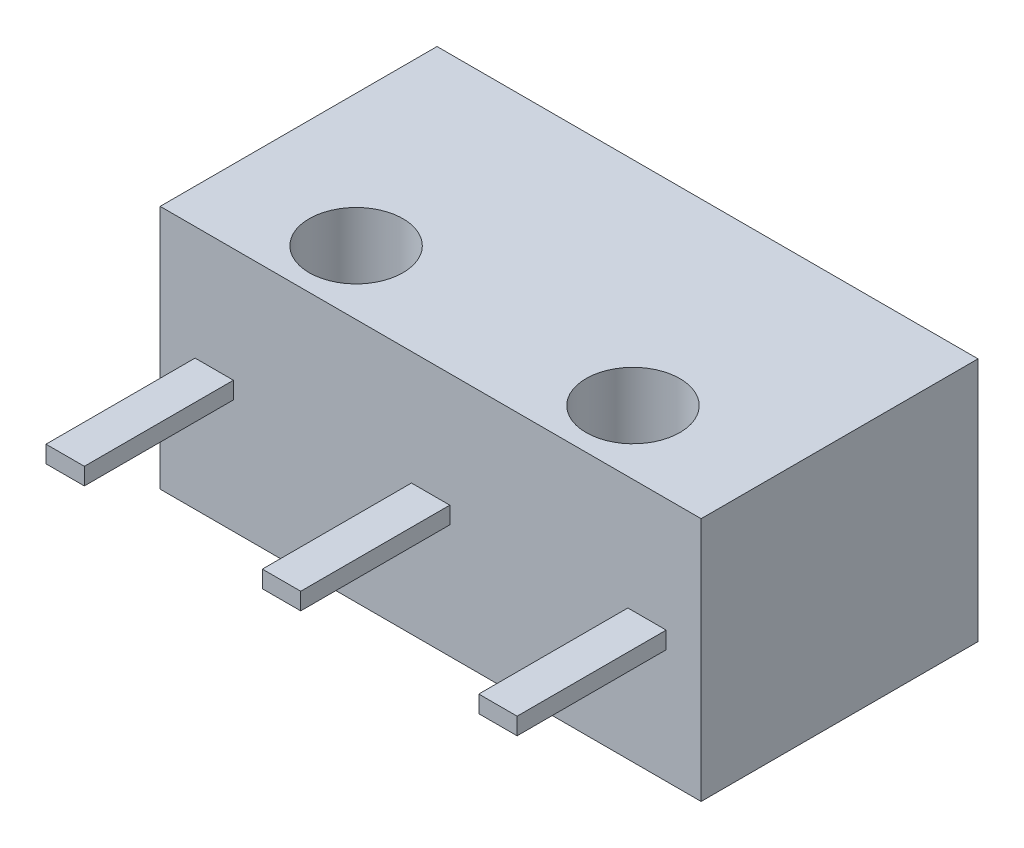
ISO-10303-21;
HEADER;
FILE_DESCRIPTION(('STEP AP214'),'2;1');
FILE_NAME('part.step','',(''),(''),'','','');
FILE_SCHEMA(('AUTOMOTIVE_DESIGN { 1 0 10303 214 1 1 1 1 }'));
ENDSEC;
DATA;
#1=APPLICATION_CONTEXT('core data for automotive mechanical design processes');
#2=APPLICATION_PROTOCOL_DEFINITION('international standard','automotive_design',2000,#1);
#3=PRODUCT_CONTEXT('',#1,'mechanical');
#4=PRODUCT('Part','Part','',(#3));
#5=PRODUCT_RELATED_PRODUCT_CATEGORY('part','',(#4));
#6=PRODUCT_DEFINITION_FORMATION('','',#4);
#7=PRODUCT_DEFINITION_CONTEXT('part definition',#1,'design');
#8=PRODUCT_DEFINITION('design','',#6,#7);
#9=PRODUCT_DEFINITION_SHAPE('','',#8);
#10=(LENGTH_UNIT() NAMED_UNIT(*) SI_UNIT(.MILLI.,.METRE.));
#11=(NAMED_UNIT(*) PLANE_ANGLE_UNIT() SI_UNIT($,.RADIAN.));
#12=(NAMED_UNIT(*) SI_UNIT($,.STERADIAN.) SOLID_ANGLE_UNIT());
#13=UNCERTAINTY_MEASURE_WITH_UNIT(LENGTH_MEASURE(1.E-05),#10,'distance_accuracy_value','');
#14=(GEOMETRIC_REPRESENTATION_CONTEXT(3) GLOBAL_UNCERTAINTY_ASSIGNED_CONTEXT((#13)) GLOBAL_UNIT_ASSIGNED_CONTEXT((#10,
#11,#12)) REPRESENTATION_CONTEXT('',''));
#15=CARTESIAN_POINT('',(0.,0.,0.));
#16=DIRECTION('',(0.,0.,1.));
#17=DIRECTION('',(1.,0.,0.));
#18=AXIS2_PLACEMENT_3D('',#15,#16,#17);
#19=CARTESIAN_POINT('',(0.,5.74999999999998,0.));
#20=DIRECTION('',(0.,0.,-1.));
#21=DIRECTION('',(-1.,0.,0.));
#22=AXIS2_PLACEMENT_3D('',#19,#20,#21);
#23=PLANE('',#22);
#24=DIRECTION('',(1.,0.,0.));
#25=VECTOR('',#24,1.);
#26=CARTESIAN_POINT('',(0.,0.,0.));
#27=LINE('',#26,#25);
#28=CARTESIAN_POINT('',(0.,0.,0.));
#29=VERTEX_POINT('',#28);
#30=CARTESIAN_POINT('',(12.7,0.,0.));
#31=VERTEX_POINT('',#30);
#32=EDGE_CURVE('E295',#29,#31,#27,.T.);
#33=ORIENTED_EDGE('',*,*,#32,.T.);
#34=DIRECTION('',(0.,-1.,0.));
#35=VECTOR('',#34,1.);
#36=CARTESIAN_POINT('',(12.6999999999999,5.75000000000001,0.));
#37=LINE('',#36,#35);
#38=CARTESIAN_POINT('',(12.6999999999999,5.75000000000001,0.));
#39=VERTEX_POINT('',#38);
#40=EDGE_CURVE('E42',#39,#31,#37,.T.);
#41=ORIENTED_EDGE('',*,*,#40,.F.);
#42=DIRECTION('',(1.,0.,0.));
#43=VECTOR('',#42,1.);
#44=CARTESIAN_POINT('',(0.,5.74999999999998,0.));
#45=LINE('',#44,#43);
#46=CARTESIAN_POINT('',(0.,5.74999999999998,0.));
#47=VERTEX_POINT('',#46);
#48=EDGE_CURVE('E285',#47,#39,#45,.T.);
#49=ORIENTED_EDGE('',*,*,#48,.F.);
#50=DIRECTION('',(0.,-1.,0.));
#51=VECTOR('',#50,1.);
#52=CARTESIAN_POINT('',(0.,5.74999999999998,0.));
#53=LINE('',#52,#51);
#54=EDGE_CURVE('E11',#47,#29,#53,.T.);
#55=ORIENTED_EDGE('',*,*,#54,.T.);
#56=EDGE_LOOP('',(#33,#41,#49,#55));
#57=FACE_BOUND('',#56,.T.);
#58=DIRECTION('',(0.,1.,0.));
#59=VECTOR('',#58,1.);
#60=CARTESIAN_POINT('',(6.79999999999992,2.67499999999998,0.));
#61=LINE('',#60,#59);
#62=CARTESIAN_POINT('',(6.79999999999992,2.67499999999998,0.));
#63=VERTEX_POINT('',#62);
#64=CARTESIAN_POINT('',(6.8,3.07500000000002,0.));
#65=VERTEX_POINT('',#64);
#66=EDGE_CURVE('E264',#63,#65,#61,.T.);
#67=ORIENTED_EDGE('',*,*,#66,.F.);
#68=DIRECTION('',(-0.999999999999999,0.,0.));
#69=VECTOR('',#68,1.);
#70=CARTESIAN_POINT('',(5.90000000000002,2.67500000000001,0.));
#71=LINE('',#70,#69);
#72=CARTESIAN_POINT('',(5.90000000000002,2.67500000000001,0.));
#73=VERTEX_POINT('',#72);
#74=EDGE_CURVE('E258',#63,#73,#71,.T.);
#75=ORIENTED_EDGE('',*,*,#74,.T.);
#76=DIRECTION('',(0.,1.,0.));
#77=VECTOR('',#76,1.);
#78=CARTESIAN_POINT('',(5.90000000000002,2.67500000000001,0.));
#79=LINE('',#78,#77);
#80=CARTESIAN_POINT('',(5.90000000000002,3.07499999999997,0.));
#81=VERTEX_POINT('',#80);
#82=EDGE_CURVE('E261',#73,#81,#79,.T.);
#83=ORIENTED_EDGE('',*,*,#82,.T.);
#84=DIRECTION('',(-0.999999999999999,0.,0.));
#85=VECTOR('',#84,1.);
#86=CARTESIAN_POINT('',(5.90000000000002,3.07499999999997,0.));
#87=LINE('',#86,#85);
#88=EDGE_CURVE('E246',#65,#81,#87,.T.);
#89=ORIENTED_EDGE('',*,*,#88,.F.);
#90=EDGE_LOOP('',(#67,#75,#83,#89));
#91=FACE_BOUND('',#90,.T.);
#92=DIRECTION('',(0.,1.,0.));
#93=VECTOR('',#92,1.);
#94=CARTESIAN_POINT('',(11.88,2.67499999999998,0.));
#95=LINE('',#94,#93);
#96=CARTESIAN_POINT('',(11.88,2.67499999999998,0.));
#97=VERTEX_POINT('',#96);
#98=CARTESIAN_POINT('',(11.8799999999999,3.07499999999999,0.));
#99=VERTEX_POINT('',#98);
#100=EDGE_CURVE('E234',#97,#99,#95,.T.);
#101=ORIENTED_EDGE('',*,*,#100,.F.);
#102=DIRECTION('',(-0.999999999999999,0.,0.));
#103=VECTOR('',#102,1.);
#104=CARTESIAN_POINT('',(11.88,2.67499999999998,0.));
#105=LINE('',#104,#103);
#106=CARTESIAN_POINT('',(10.9799999999999,2.67499999999996,0.));
#107=VERTEX_POINT('',#106);
#108=EDGE_CURVE('E223',#97,#107,#105,.T.);
#109=ORIENTED_EDGE('',*,*,#108,.T.);
#110=DIRECTION('',(0.,1.,0.));
#111=VECTOR('',#110,1.);
#112=CARTESIAN_POINT('',(10.9799999999999,2.67499999999996,0.));
#113=LINE('',#112,#111);
#114=CARTESIAN_POINT('',(10.98,3.07499999999999,0.));
#115=VERTEX_POINT('',#114);
#116=EDGE_CURVE('E232',#107,#115,#113,.T.);
#117=ORIENTED_EDGE('',*,*,#116,.T.);
#118=DIRECTION('',(-0.999999999999999,0.,0.));
#119=VECTOR('',#118,1.);
#120=CARTESIAN_POINT('',(11.8799999999999,3.07499999999999,0.));
#121=LINE('',#120,#119);
#122=EDGE_CURVE('E212',#99,#115,#121,.T.);
#123=ORIENTED_EDGE('',*,*,#122,.F.);
#124=EDGE_LOOP('',(#101,#109,#117,#123));
#125=FACE_BOUND('',#124,.T.);
#126=DIRECTION('',(-0.999999999999999,0.,0.));
#127=VECTOR('',#126,1.);
#128=CARTESIAN_POINT('',(0.819999999999932,2.67499999999996,0.));
#129=LINE('',#128,#127);
#130=CARTESIAN_POINT('',(1.72,2.67499999999998,0.));
#131=VERTEX_POINT('',#130);
#132=CARTESIAN_POINT('',(0.819999999999932,2.67499999999996,0.));
#133=VERTEX_POINT('',#132);
#134=EDGE_CURVE('E193',#131,#133,#129,.T.);
#135=ORIENTED_EDGE('',*,*,#134,.T.);
#136=DIRECTION('',(0.,1.,0.));
#137=VECTOR('',#136,1.);
#138=CARTESIAN_POINT('',(0.819999999999932,2.67499999999996,0.));
#139=LINE('',#138,#137);
#140=CARTESIAN_POINT('',(0.819999999999932,3.07499999999994,0.));
#141=VERTEX_POINT('',#140);
#142=EDGE_CURVE('E197',#133,#141,#139,.T.);
#143=ORIENTED_EDGE('',*,*,#142,.T.);
#144=DIRECTION('',(-0.999999999999999,0.,0.));
#145=VECTOR('',#144,1.);
#146=CARTESIAN_POINT('',(0.819999999999932,3.07499999999994,0.));
#147=LINE('',#146,#145);
#148=CARTESIAN_POINT('',(1.72000000000005,3.07500000000002,0.));
#149=VERTEX_POINT('',#148);
#150=EDGE_CURVE('E184',#149,#141,#147,.T.);
#151=ORIENTED_EDGE('',*,*,#150,.F.);
#152=DIRECTION('',(0.,1.,0.));
#153=VECTOR('',#152,1.);
#154=CARTESIAN_POINT('',(1.72,2.67499999999998,0.));
#155=LINE('',#154,#153);
#156=EDGE_CURVE('E201',#131,#149,#155,.T.);
#157=ORIENTED_EDGE('',*,*,#156,.F.);
#158=EDGE_LOOP('',(#135,#143,#151,#157));
#159=FACE_BOUND('',#158,.T.);
#160=ADVANCED_FACE('F34',(#57,#91,#125,#159),#23,.F.);
#161=CARTESIAN_POINT('',(0.,5.74999999999998,0.));
#162=DIRECTION('',(1.,0.,0.));
#163=DIRECTION('',(0.,0.,-1.));
#164=AXIS2_PLACEMENT_3D('',#161,#162,#163);
#165=PLANE('',#164);
#166=DIRECTION('',(0.,0.,1.));
#167=VECTOR('',#166,1.);
#168=CARTESIAN_POINT('',(0.,0.,0.));
#169=LINE('',#168,#167);
#170=CARTESIAN_POINT('',(0.,0.,-6.50000000000001));
#171=VERTEX_POINT('',#170);
#172=EDGE_CURVE('E273',#171,#29,#169,.T.);
#173=ORIENTED_EDGE('',*,*,#172,.T.);
#174=ORIENTED_EDGE('',*,*,#54,.F.);
#175=DIRECTION('',(0.,0.,1.));
#176=VECTOR('',#175,1.);
#177=CARTESIAN_POINT('',(0.,5.74999999999998,0.));
#178=LINE('',#177,#176);
#179=CARTESIAN_POINT('',(0.,5.75000000000003,-6.50000000000001));
#180=VERTEX_POINT('',#179);
#181=EDGE_CURVE('E282',#180,#47,#178,.T.);
#182=ORIENTED_EDGE('',*,*,#181,.F.);
#183=DIRECTION('',(0.,-1.,0.));
#184=VECTOR('',#183,1.);
#185=CARTESIAN_POINT('',(0.,5.75000000000003,-6.50000000000001));
#186=LINE('',#185,#184);
#187=EDGE_CURVE('E292',#180,#171,#186,.T.);
#188=ORIENTED_EDGE('',*,*,#187,.T.);
#189=EDGE_LOOP('',(#173,#174,#182,#188));
#190=FACE_BOUND('',#189,.T.);
#191=ADVANCED_FACE('F36',(#190),#165,.F.);
#192=CARTESIAN_POINT('',(12.6999999999999,5.75000000000001,0.));
#193=DIRECTION('',(-1.,0.,0.));
#194=DIRECTION('',(0.,0.,1.));
#195=AXIS2_PLACEMENT_3D('',#192,#193,#194);
#196=PLANE('',#195);
#197=DIRECTION('',(0.,0.,-1.));
#198=VECTOR('',#197,1.);
#199=CARTESIAN_POINT('',(12.7,0.,0.));
#200=LINE('',#199,#198);
#201=CARTESIAN_POINT('',(12.7,0.,-6.50000000000006));
#202=VERTEX_POINT('',#201);
#203=EDGE_CURVE('E297',#31,#202,#200,.T.);
#204=ORIENTED_EDGE('',*,*,#203,.T.);
#205=DIRECTION('',(0.,-1.,0.));
#206=VECTOR('',#205,1.);
#207=CARTESIAN_POINT('',(12.6999999999999,5.74999999999998,-6.50000000000001));
#208=LINE('',#207,#206);
#209=CARTESIAN_POINT('',(12.6999999999999,5.74999999999998,-6.50000000000001));
#210=VERTEX_POINT('',#209);
#211=EDGE_CURVE('E302',#210,#202,#208,.T.);
#212=ORIENTED_EDGE('',*,*,#211,.F.);
#213=DIRECTION('',(0.,0.,-1.));
#214=VECTOR('',#213,1.);
#215=CARTESIAN_POINT('',(12.6999999999999,5.75000000000001,0.));
#216=LINE('',#215,#214);
#217=EDGE_CURVE('E288',#39,#210,#216,.T.);
#218=ORIENTED_EDGE('',*,*,#217,.F.);
#219=ORIENTED_EDGE('',*,*,#40,.T.);
#220=EDGE_LOOP('',(#204,#212,#218,#219));
#221=FACE_BOUND('',#220,.T.);
#222=ADVANCED_FACE('F309',(#221),#196,.F.);
#223=CARTESIAN_POINT('',(0.,5.75000000000003,-6.50000000000001));
#224=DIRECTION('',(0.,0.,1.));
#225=DIRECTION('',(1.,0.,0.));
#226=AXIS2_PLACEMENT_3D('',#223,#224,#225);
#227=PLANE('',#226);
#228=DIRECTION('',(0.,1.,0.));
#229=VECTOR('',#228,1.);
#230=CARTESIAN_POINT('',(3.80000000000003,1.42500000000001,-6.49999999999995));
#231=LINE('',#230,#229);
#232=CARTESIAN_POINT('',(3.80000000000003,1.42500000000001,-6.49999999999995));
#233=VERTEX_POINT('',#232);
#234=CARTESIAN_POINT('',(3.79999999999997,4.325,-6.50000000000001));
#235=VERTEX_POINT('',#234);
#236=EDGE_CURVE('E54',#233,#235,#231,.T.);
#237=ORIENTED_EDGE('',*,*,#236,.F.);
#238=DIRECTION('',(0.999999999999999,0.,0.));
#239=VECTOR('',#238,1.);
#240=CARTESIAN_POINT('',(3.80000000000003,1.42500000000001,-6.49999999999995));
#241=LINE('',#240,#239);
#242=CARTESIAN_POINT('',(4.99999999999989,1.42500000000001,-6.50000000000001));
#243=VERTEX_POINT('',#242);
#244=EDGE_CURVE('E49',#233,#243,#241,.T.);
#245=ORIENTED_EDGE('',*,*,#244,.T.);
#246=DIRECTION('',(0.,1.,0.));
#247=VECTOR('',#246,1.);
#248=CARTESIAN_POINT('',(4.99999999999989,1.42500000000001,-6.50000000000001));
#249=LINE('',#248,#247);
#250=CARTESIAN_POINT('',(5.,4.325,-6.50000000000001));
#251=VERTEX_POINT('',#250);
#252=EDGE_CURVE('E155',#243,#251,#249,.T.);
#253=ORIENTED_EDGE('',*,*,#252,.T.);
#254=DIRECTION('',(0.999999999999999,0.,0.));
#255=VECTOR('',#254,1.);
#256=CARTESIAN_POINT('',(3.79999999999997,4.325,-6.50000000000001));
#257=LINE('',#256,#255);
#258=EDGE_CURVE('E159',#235,#251,#257,.T.);
#259=ORIENTED_EDGE('',*,*,#258,.F.);
#260=EDGE_LOOP('',(#237,#245,#253,#259));
#261=FACE_BOUND('',#260,.T.);
#262=DIRECTION('',(-1.,0.,0.));
#263=VECTOR('',#262,1.);
#264=CARTESIAN_POINT('',(0.,0.,-6.50000000000001));
#265=LINE('',#264,#263);
#266=EDGE_CURVE('E286',#202,#171,#265,.T.);
#267=ORIENTED_EDGE('',*,*,#266,.T.);
#268=ORIENTED_EDGE('',*,*,#187,.F.);
#269=DIRECTION('',(-1.,0.,0.));
#270=VECTOR('',#269,1.);
#271=CARTESIAN_POINT('',(0.,5.75000000000003,-6.50000000000001));
#272=LINE('',#271,#270);
#273=EDGE_CURVE('E290',#210,#180,#272,.T.);
#274=ORIENTED_EDGE('',*,*,#273,.F.);
#275=ORIENTED_EDGE('',*,*,#211,.T.);
#276=EDGE_LOOP('',(#267,#268,#274,#275));
#277=FACE_BOUND('',#276,.T.);
#278=ADVANCED_FACE('F157',(#261,#277),#227,.F.);
#279=CARTESIAN_POINT('',(0.,5.74999999999998,0.));
#280=DIRECTION('',(0.,-1.,0.));
#281=DIRECTION('',(0.,0.,-1.));
#282=AXIS2_PLACEMENT_3D('',#279,#280,#281);
#283=PLANE('',#282);
#284=CARTESIAN_POINT('',(3.09999999999999,5.74999999999998,-1.5));
#285=DIRECTION('',(0.,1.,0.));
#286=DIRECTION('',(0.,0.,1.));
#287=AXIS2_PLACEMENT_3D('',#284,#285,#286);
#288=CIRCLE('',#287,1.1);
#289=CARTESIAN_POINT('',(3.09999999999999,5.74999999999998,-0.400000000000001));
#290=VERTEX_POINT('',#289);
#291=EDGE_CURVE('E274',#290,#290,#288,.T.);
#292=ORIENTED_EDGE('',*,*,#291,.F.);
#293=EDGE_LOOP('',(#292));
#294=FACE_BOUND('',#293,.T.);
#295=CARTESIAN_POINT('',(9.60000000000002,5.75000000000001,-1.5));
#296=DIRECTION('',(0.,1.,0.));
#297=DIRECTION('',(0.,0.,1.));
#298=AXIS2_PLACEMENT_3D('',#295,#296,#297);
#299=CIRCLE('',#298,1.1);
#300=CARTESIAN_POINT('',(9.60000000000002,5.75000000000001,-0.4));
#301=VERTEX_POINT('',#300);
#302=EDGE_CURVE('E263',#301,#301,#299,.T.);
#303=ORIENTED_EDGE('',*,*,#302,.F.);
#304=EDGE_LOOP('',(#303));
#305=FACE_BOUND('',#304,.T.);
#306=ORIENTED_EDGE('',*,*,#181,.T.);
#307=ORIENTED_EDGE('',*,*,#48,.T.);
#308=ORIENTED_EDGE('',*,*,#217,.T.);
#309=ORIENTED_EDGE('',*,*,#273,.T.);
#310=EDGE_LOOP('',(#306,#307,#308,#309));
#311=FACE_BOUND('',#310,.T.);
#312=ADVANCED_FACE('F322',(#294,#305,#311),#283,.F.);
#313=CARTESIAN_POINT('',(0.,0.,0.));
#314=DIRECTION('',(0.,-1.,0.));
#315=DIRECTION('',(0.,0.,-1.));
#316=AXIS2_PLACEMENT_3D('',#313,#314,#315);
#317=PLANE('',#316);
#318=CARTESIAN_POINT('',(3.09999999999999,0.,-1.5));
#319=DIRECTION('',(0.,1.,0.));
#320=DIRECTION('',(0.,0.,1.));
#321=AXIS2_PLACEMENT_3D('',#318,#319,#320);
#322=CIRCLE('',#321,1.1);
#323=CARTESIAN_POINT('',(3.09999999999999,0.,-0.400000000000001));
#324=VERTEX_POINT('',#323);
#325=EDGE_CURVE('E270',#324,#324,#322,.T.);
#326=ORIENTED_EDGE('',*,*,#325,.T.);
#327=EDGE_LOOP('',(#326));
#328=FACE_BOUND('',#327,.T.);
#329=CARTESIAN_POINT('',(9.59999999999991,0.,-1.5));
#330=DIRECTION('',(0.,1.,0.));
#331=DIRECTION('',(0.,0.,1.));
#332=AXIS2_PLACEMENT_3D('',#329,#330,#331);
#333=CIRCLE('',#332,1.1);
#334=CARTESIAN_POINT('',(9.59999999999991,0.,-0.4));
#335=VERTEX_POINT('',#334);
#336=EDGE_CURVE('E277',#335,#335,#333,.T.);
#337=ORIENTED_EDGE('',*,*,#336,.T.);
#338=EDGE_LOOP('',(#337));
#339=FACE_BOUND('',#338,.T.);
#340=ORIENTED_EDGE('',*,*,#172,.F.);
#341=ORIENTED_EDGE('',*,*,#266,.F.);
#342=ORIENTED_EDGE('',*,*,#203,.F.);
#343=ORIENTED_EDGE('',*,*,#32,.F.);
#344=EDGE_LOOP('',(#340,#341,#342,#343));
#345=FACE_BOUND('',#344,.T.);
#346=ADVANCED_FACE('F315',(#328,#339,#345),#317,.T.);
#347=CARTESIAN_POINT('',(9.59999999999991,0.,-1.5));
#348=DIRECTION('',(0.,1.,0.));
#349=DIRECTION('',(0.,0.,1.));
#350=AXIS2_PLACEMENT_3D('',#347,#348,#349);
#351=CYLINDRICAL_SURFACE('',#350,1.1);
#352=ORIENTED_EDGE('',*,*,#336,.F.);
#353=EDGE_LOOP('',(#352));
#354=FACE_BOUND('',#353,.T.);
#355=ORIENTED_EDGE('',*,*,#302,.T.);
#356=EDGE_LOOP('',(#355));
#357=FACE_BOUND('',#356,.T.);
#358=ADVANCED_FACE('F402',(#354,#357),#351,.F.);
#359=CARTESIAN_POINT('',(3.09999999999999,0.,-1.5));
#360=DIRECTION('',(0.,1.,0.));
#361=DIRECTION('',(0.,0.,1.));
#362=AXIS2_PLACEMENT_3D('',#359,#360,#361);
#363=CYLINDRICAL_SURFACE('',#362,1.1);
#364=ORIENTED_EDGE('',*,*,#325,.F.);
#365=EDGE_LOOP('',(#364));
#366=FACE_BOUND('',#365,.T.);
#367=ORIENTED_EDGE('',*,*,#291,.T.);
#368=EDGE_LOOP('',(#367));
#369=FACE_BOUND('',#368,.T.);
#370=ADVANCED_FACE('F398',(#366,#369),#363,.F.);
#371=CARTESIAN_POINT('',(5.90000000000002,2.67500000000001,3.5));
#372=DIRECTION('',(-1.,0.,0.));
#373=DIRECTION('',(0.,0.,1.));
#374=AXIS2_PLACEMENT_3D('',#371,#372,#373);
#375=PLANE('',#374);
#376=DIRECTION('',(0.,1.,0.));
#377=VECTOR('',#376,1.);
#378=CARTESIAN_POINT('',(5.90000000000002,2.67500000000001,3.5));
#379=LINE('',#378,#377);
#380=CARTESIAN_POINT('',(5.90000000000002,2.67500000000001,3.5));
#381=VERTEX_POINT('',#380);
#382=CARTESIAN_POINT('',(5.89999999999993,3.07499999999999,3.49999999999995));
#383=VERTEX_POINT('',#382);
#384=EDGE_CURVE('E260',#381,#383,#379,.T.);
#385=ORIENTED_EDGE('',*,*,#384,.T.);
#386=DIRECTION('',(0.,0.,1.));
#387=VECTOR('',#386,1.);
#388=CARTESIAN_POINT('',(5.89999999999993,3.07499999999999,3.49999999999995));
#389=LINE('',#388,#387);
#390=EDGE_CURVE('E231',#81,#383,#389,.T.);
#391=ORIENTED_EDGE('',*,*,#390,.F.);
#392=ORIENTED_EDGE('',*,*,#82,.F.);
#393=DIRECTION('',(0.,0.,1.));
#394=VECTOR('',#393,1.);
#395=CARTESIAN_POINT('',(5.90000000000002,2.67500000000001,3.5));
#396=LINE('',#395,#394);
#397=EDGE_CURVE('E249',#73,#381,#396,.T.);
#398=ORIENTED_EDGE('',*,*,#397,.T.);
#399=EDGE_LOOP('',(#385,#391,#392,#398));
#400=FACE_BOUND('',#399,.T.);
#401=ADVANCED_FACE('F391',(#400),#375,.T.);
#402=CARTESIAN_POINT('',(6.79999999999997,2.67500000000001,3.5));
#403=DIRECTION('',(1.,0.,0.));
#404=DIRECTION('',(0.,0.,-1.));
#405=AXIS2_PLACEMENT_3D('',#402,#403,#404);
#406=PLANE('',#405);
#407=ORIENTED_EDGE('',*,*,#66,.T.);
#408=DIRECTION('',(0.,0.,-1.));
#409=VECTOR('',#408,1.);
#410=CARTESIAN_POINT('',(6.80000000000003,3.07499999999999,3.49999999999995));
#411=LINE('',#410,#409);
#412=CARTESIAN_POINT('',(6.80000000000003,3.07499999999999,3.49999999999995));
#413=VERTEX_POINT('',#412);
#414=EDGE_CURVE('E243',#413,#65,#411,.T.);
#415=ORIENTED_EDGE('',*,*,#414,.F.);
#416=DIRECTION('',(0.,1.,0.));
#417=VECTOR('',#416,1.);
#418=CARTESIAN_POINT('',(6.79999999999997,2.67500000000001,3.5));
#419=LINE('',#418,#417);
#420=CARTESIAN_POINT('',(6.79999999999997,2.67500000000001,3.5));
#421=VERTEX_POINT('',#420);
#422=EDGE_CURVE('E267',#421,#413,#419,.T.);
#423=ORIENTED_EDGE('',*,*,#422,.F.);
#424=DIRECTION('',(0.,0.,-1.));
#425=VECTOR('',#424,1.);
#426=CARTESIAN_POINT('',(6.79999999999997,2.67500000000001,3.5));
#427=LINE('',#426,#425);
#428=EDGE_CURVE('E255',#421,#63,#427,.T.);
#429=ORIENTED_EDGE('',*,*,#428,.T.);
#430=EDGE_LOOP('',(#407,#415,#423,#429));
#431=FACE_BOUND('',#430,.T.);
#432=ADVANCED_FACE('F388',(#431),#406,.T.);
#433=CARTESIAN_POINT('',(5.90000000000002,2.67500000000001,3.5));
#434=DIRECTION('',(0.,0.,1.));
#435=DIRECTION('',(0.999999999999999,0.,0.));
#436=AXIS2_PLACEMENT_3D('',#433,#434,#435);
#437=PLANE('',#436);
#438=ORIENTED_EDGE('',*,*,#422,.T.);
#439=DIRECTION('',(0.999999999999999,0.,0.));
#440=VECTOR('',#439,1.);
#441=CARTESIAN_POINT('',(5.89999999999993,3.07499999999999,3.49999999999995));
#442=LINE('',#441,#440);
#443=EDGE_CURVE('E240',#383,#413,#442,.T.);
#444=ORIENTED_EDGE('',*,*,#443,.F.);
#445=ORIENTED_EDGE('',*,*,#384,.F.);
#446=DIRECTION('',(0.999999999999999,0.,0.));
#447=VECTOR('',#446,1.);
#448=CARTESIAN_POINT('',(5.90000000000002,2.67500000000001,3.5));
#449=LINE('',#448,#447);
#450=EDGE_CURVE('E252',#381,#421,#449,.T.);
#451=ORIENTED_EDGE('',*,*,#450,.T.);
#452=EDGE_LOOP('',(#438,#444,#445,#451));
#453=FACE_BOUND('',#452,.T.);
#454=ADVANCED_FACE('F386',(#453),#437,.T.);
#455=CARTESIAN_POINT('',(0.,2.67499999999998,0.));
#456=DIRECTION('',(0.,-1.,0.));
#457=DIRECTION('',(0.,0.,-1.));
#458=AXIS2_PLACEMENT_3D('',#455,#456,#457);
#459=PLANE('',#458);
#460=ORIENTED_EDGE('',*,*,#397,.F.);
#461=ORIENTED_EDGE('',*,*,#74,.F.);
#462=ORIENTED_EDGE('',*,*,#428,.F.);
#463=ORIENTED_EDGE('',*,*,#450,.F.);
#464=EDGE_LOOP('',(#460,#461,#462,#463));
#465=FACE_BOUND('',#464,.T.);
#466=ADVANCED_FACE('F382',(#465),#459,.T.);
#467=CARTESIAN_POINT('',(0.,3.07499999999999,0.));
#468=DIRECTION('',(0.,-1.,0.));
#469=DIRECTION('',(0.,0.,-1.));
#470=AXIS2_PLACEMENT_3D('',#467,#468,#469);
#471=PLANE('',#470);
#472=ORIENTED_EDGE('',*,*,#390,.T.);
#473=ORIENTED_EDGE('',*,*,#443,.T.);
#474=ORIENTED_EDGE('',*,*,#414,.T.);
#475=ORIENTED_EDGE('',*,*,#88,.T.);
#476=EDGE_LOOP('',(#472,#473,#474,#475));
#477=FACE_BOUND('',#476,.T.);
#478=ADVANCED_FACE('F372',(#477),#471,.F.);
#479=CARTESIAN_POINT('',(10.9799999999999,2.67499999999998,3.5));
#480=DIRECTION('',(-1.,0.,0.));
#481=DIRECTION('',(0.,0.,1.));
#482=AXIS2_PLACEMENT_3D('',#479,#480,#481);
#483=PLANE('',#482);
#484=DIRECTION('',(0.,1.,0.));
#485=VECTOR('',#484,1.);
#486=CARTESIAN_POINT('',(10.9799999999999,2.67499999999998,3.5));
#487=LINE('',#486,#485);
#488=CARTESIAN_POINT('',(10.9799999999999,2.67499999999998,3.5));
#489=VERTEX_POINT('',#488);
#490=CARTESIAN_POINT('',(10.98,3.07499999999997,3.49999999999989));
#491=VERTEX_POINT('',#490);
#492=EDGE_CURVE('E229',#489,#491,#487,.T.);
#493=ORIENTED_EDGE('',*,*,#492,.T.);
#494=DIRECTION('',(0.,0.,1.));
#495=VECTOR('',#494,1.);
#496=CARTESIAN_POINT('',(10.98,3.07499999999997,3.49999999999989));
#497=LINE('',#496,#495);
#498=EDGE_CURVE('E215',#115,#491,#497,.T.);
#499=ORIENTED_EDGE('',*,*,#498,.F.);
#500=ORIENTED_EDGE('',*,*,#116,.F.);
#501=DIRECTION('',(0.,0.,1.));
#502=VECTOR('',#501,1.);
#503=CARTESIAN_POINT('',(10.9799999999999,2.67499999999998,3.5));
#504=LINE('',#503,#502);
#505=EDGE_CURVE('E225',#107,#489,#504,.T.);
#506=ORIENTED_EDGE('',*,*,#505,.T.);
#507=EDGE_LOOP('',(#493,#499,#500,#506));
#508=FACE_BOUND('',#507,.T.);
#509=ADVANCED_FACE('F368',(#508),#483,.T.);
#510=CARTESIAN_POINT('',(11.88,2.67499999999998,0.));
#511=DIRECTION('',(1.,0.,0.));
#512=DIRECTION('',(0.,0.,-1.));
#513=AXIS2_PLACEMENT_3D('',#510,#511,#512);
#514=PLANE('',#513);
#515=ORIENTED_EDGE('',*,*,#100,.T.);
#516=DIRECTION('',(0.,0.,-1.));
#517=VECTOR('',#516,1.);
#518=CARTESIAN_POINT('',(11.8799999999999,3.07499999999999,0.));
#519=LINE('',#518,#517);
#520=CARTESIAN_POINT('',(11.8799999999999,3.07499999999997,3.50000000000006));
#521=VERTEX_POINT('',#520);
#522=EDGE_CURVE('E209',#521,#99,#519,.T.);
#523=ORIENTED_EDGE('',*,*,#522,.F.);
#524=DIRECTION('',(0.,1.,0.));
#525=VECTOR('',#524,1.);
#526=CARTESIAN_POINT('',(11.8799999999999,2.67499999999996,3.5));
#527=LINE('',#526,#525);
#528=CARTESIAN_POINT('',(11.8799999999999,2.67499999999996,3.5));
#529=VERTEX_POINT('',#528);
#530=EDGE_CURVE('E228',#529,#521,#527,.T.);
#531=ORIENTED_EDGE('',*,*,#530,.F.);
#532=DIRECTION('',(0.,0.,-1.));
#533=VECTOR('',#532,1.);
#534=CARTESIAN_POINT('',(11.88,2.67499999999998,0.));
#535=LINE('',#534,#533);
#536=EDGE_CURVE('E220',#529,#97,#535,.T.);
#537=ORIENTED_EDGE('',*,*,#536,.T.);
#538=EDGE_LOOP('',(#515,#523,#531,#537));
#539=FACE_BOUND('',#538,.T.);
#540=ADVANCED_FACE('F371',(#539),#514,.T.);
#541=CARTESIAN_POINT('',(11.8799999999999,2.67499999999996,3.5));
#542=DIRECTION('',(0.,0.,1.));
#543=DIRECTION('',(0.999999999999999,0.,0.));
#544=AXIS2_PLACEMENT_3D('',#541,#542,#543);
#545=PLANE('',#544);
#546=ORIENTED_EDGE('',*,*,#530,.T.);
#547=DIRECTION('',(0.999999999999999,0.,0.));
#548=VECTOR('',#547,1.);
#549=CARTESIAN_POINT('',(11.4299999999999,3.07499999999997,3.5));
#550=LINE('',#549,#548);
#551=EDGE_CURVE('E200',#491,#521,#550,.T.);
#552=ORIENTED_EDGE('',*,*,#551,.F.);
#553=ORIENTED_EDGE('',*,*,#492,.F.);
#554=DIRECTION('',(0.999999999999999,0.,0.));
#555=VECTOR('',#554,1.);
#556=CARTESIAN_POINT('',(11.4299999999999,2.67499999999998,3.5));
#557=LINE('',#556,#555);
#558=EDGE_CURVE('E218',#489,#529,#557,.T.);
#559=ORIENTED_EDGE('',*,*,#558,.T.);
#560=EDGE_LOOP('',(#546,#552,#553,#559));
#561=FACE_BOUND('',#560,.T.);
#562=ADVANCED_FACE('F366',(#561),#545,.T.);
#563=CARTESIAN_POINT('',(0.,2.67499999999998,0.));
#564=DIRECTION('',(0.,-1.,0.));
#565=DIRECTION('',(0.,0.,-1.));
#566=AXIS2_PLACEMENT_3D('',#563,#564,#565);
#567=PLANE('',#566);
#568=ORIENTED_EDGE('',*,*,#558,.F.);
#569=ORIENTED_EDGE('',*,*,#505,.F.);
#570=ORIENTED_EDGE('',*,*,#108,.F.);
#571=ORIENTED_EDGE('',*,*,#536,.F.);
#572=EDGE_LOOP('',(#568,#569,#570,#571));
#573=FACE_BOUND('',#572,.T.);
#574=ADVANCED_FACE('F362',(#573),#567,.T.);
#575=CARTESIAN_POINT('',(0.,3.07499999999999,0.));
#576=DIRECTION('',(0.,-1.,0.));
#577=DIRECTION('',(0.,0.,-1.));
#578=AXIS2_PLACEMENT_3D('',#575,#576,#577);
#579=PLANE('',#578);
#580=ORIENTED_EDGE('',*,*,#551,.T.);
#581=ORIENTED_EDGE('',*,*,#522,.T.);
#582=ORIENTED_EDGE('',*,*,#122,.T.);
#583=ORIENTED_EDGE('',*,*,#498,.T.);
#584=EDGE_LOOP('',(#580,#581,#582,#583));
#585=FACE_BOUND('',#584,.T.);
#586=ADVANCED_FACE('F359',(#585),#579,.F.);
#587=CARTESIAN_POINT('',(0.819999999999932,2.67499999999996,0.));
#588=DIRECTION('',(-1.,0.,0.));
#589=DIRECTION('',(0.,0.,1.));
#590=AXIS2_PLACEMENT_3D('',#587,#588,#589);
#591=PLANE('',#590);
#592=DIRECTION('',(0.,1.,0.));
#593=VECTOR('',#592,1.);
#594=CARTESIAN_POINT('',(0.819999999999987,2.67499999999998,3.49999999999995));
#595=LINE('',#594,#593);
#596=CARTESIAN_POINT('',(0.819999999999987,2.67499999999998,3.49999999999995));
#597=VERTEX_POINT('',#596);
#598=CARTESIAN_POINT('',(0.819999999999932,3.07499999999997,3.49999999999989));
#599=VERTEX_POINT('',#598);
#600=EDGE_CURVE('E196',#597,#599,#595,.T.);
#601=ORIENTED_EDGE('',*,*,#600,.T.);
#602=DIRECTION('',(0.,0.,1.));
#603=VECTOR('',#602,1.);
#604=CARTESIAN_POINT('',(0.819999999999932,3.07499999999994,0.));
#605=LINE('',#604,#603);
#606=EDGE_CURVE('E163',#141,#599,#605,.T.);
#607=ORIENTED_EDGE('',*,*,#606,.F.);
#608=ORIENTED_EDGE('',*,*,#142,.F.);
#609=DIRECTION('',(0.,0.,1.));
#610=VECTOR('',#609,1.);
#611=CARTESIAN_POINT('',(0.819999999999932,2.67499999999996,0.));
#612=LINE('',#611,#610);
#613=EDGE_CURVE('E186',#133,#597,#612,.T.);
#614=ORIENTED_EDGE('',*,*,#613,.T.);
#615=EDGE_LOOP('',(#601,#607,#608,#614));
#616=FACE_BOUND('',#615,.T.);
#617=ADVANCED_FACE('F337',(#616),#591,.T.);
#618=CARTESIAN_POINT('',(1.71999999999994,2.67499999999998,3.5));
#619=DIRECTION('',(1.,0.,0.));
#620=DIRECTION('',(0.,0.,-1.));
#621=AXIS2_PLACEMENT_3D('',#618,#619,#620);
#622=PLANE('',#621);
#623=ORIENTED_EDGE('',*,*,#156,.T.);
#624=DIRECTION('',(0.,0.,-1.));
#625=VECTOR('',#624,1.);
#626=CARTESIAN_POINT('',(1.71999999999997,3.07499999999999,3.5));
#627=LINE('',#626,#625);
#628=CARTESIAN_POINT('',(1.71999999999997,3.07499999999999,3.5));
#629=VERTEX_POINT('',#628);
#630=EDGE_CURVE('E182',#629,#149,#627,.T.);
#631=ORIENTED_EDGE('',*,*,#630,.F.);
#632=DIRECTION('',(0.,1.,0.));
#633=VECTOR('',#632,1.);
#634=CARTESIAN_POINT('',(1.71999999999994,2.67499999999998,3.5));
#635=LINE('',#634,#633);
#636=CARTESIAN_POINT('',(1.71999999999994,2.67499999999998,3.5));
#637=VERTEX_POINT('',#636);
#638=EDGE_CURVE('E204',#637,#629,#635,.T.);
#639=ORIENTED_EDGE('',*,*,#638,.F.);
#640=DIRECTION('',(0.,0.,-1.));
#641=VECTOR('',#640,1.);
#642=CARTESIAN_POINT('',(1.71999999999994,2.67499999999998,3.5));
#643=LINE('',#642,#641);
#644=EDGE_CURVE('E191',#637,#131,#643,.T.);
#645=ORIENTED_EDGE('',*,*,#644,.T.);
#646=EDGE_LOOP('',(#623,#631,#639,#645));
#647=FACE_BOUND('',#646,.T.);
#648=ADVANCED_FACE('F345',(#647),#622,.T.);
#649=CARTESIAN_POINT('',(1.26999999999999,2.67499999999996,3.5));
#650=DIRECTION('',(0.,0.,1.));
#651=DIRECTION('',(0.999999999999999,0.,0.));
#652=AXIS2_PLACEMENT_3D('',#649,#650,#651);
#653=PLANE('',#652);
#654=ORIENTED_EDGE('',*,*,#638,.T.);
#655=DIRECTION('',(0.999999999999999,0.,0.));
#656=VECTOR('',#655,1.);
#657=CARTESIAN_POINT('',(0.819999999999932,3.07499999999997,3.49999999999989));
#658=LINE('',#657,#656);
#659=EDGE_CURVE('E179',#599,#629,#658,.T.);
#660=ORIENTED_EDGE('',*,*,#659,.F.);
#661=ORIENTED_EDGE('',*,*,#600,.F.);
#662=DIRECTION('',(0.999999999999999,0.,0.));
#663=VECTOR('',#662,1.);
#664=CARTESIAN_POINT('',(0.819999999999987,2.67499999999998,3.49999999999995));
#665=LINE('',#664,#663);
#666=EDGE_CURVE('E189',#597,#637,#665,.T.);
#667=ORIENTED_EDGE('',*,*,#666,.T.);
#668=EDGE_LOOP('',(#654,#660,#661,#667));
#669=FACE_BOUND('',#668,.T.);
#670=ADVANCED_FACE('F347',(#669),#653,.T.);
#671=CARTESIAN_POINT('',(0.,2.67499999999998,0.));
#672=DIRECTION('',(0.,1.,0.));
#673=DIRECTION('',(0.,0.,1.));
#674=AXIS2_PLACEMENT_3D('',#671,#672,#673);
#675=PLANE('',#674);
#676=ORIENTED_EDGE('',*,*,#613,.F.);
#677=ORIENTED_EDGE('',*,*,#134,.F.);
#678=ORIENTED_EDGE('',*,*,#644,.F.);
#679=ORIENTED_EDGE('',*,*,#666,.F.);
#680=EDGE_LOOP('',(#676,#677,#678,#679));
#681=FACE_BOUND('',#680,.T.);
#682=ADVANCED_FACE('F334',(#681),#675,.F.);
#683=CARTESIAN_POINT('',(0.,3.07499999999999,0.));
#684=DIRECTION('',(0.,1.,0.));
#685=DIRECTION('',(0.,0.,1.));
#686=AXIS2_PLACEMENT_3D('',#683,#684,#685);
#687=PLANE('',#686);
#688=ORIENTED_EDGE('',*,*,#606,.T.);
#689=ORIENTED_EDGE('',*,*,#659,.T.);
#690=ORIENTED_EDGE('',*,*,#630,.T.);
#691=ORIENTED_EDGE('',*,*,#150,.T.);
#692=EDGE_LOOP('',(#688,#689,#690,#691));
#693=FACE_BOUND('',#692,.T.);
#694=ADVANCED_FACE('F341',(#693),#687,.T.);
#695=CARTESIAN_POINT('',(4.39999999999993,1.42500000000001,-6.50000000000006));
#696=DIRECTION('',(0.,1.,0.));
#697=DIRECTION('',(0.,0.,1.));
#698=AXIS2_PLACEMENT_3D('',#695,#696,#697);
#699=CYLINDRICAL_SURFACE('',#698,0.6);
#700=ORIENTED_EDGE('',*,*,#236,.T.);
#701=CARTESIAN_POINT('',(4.40000000000001,4.32499999999997,-6.50000000000001));
#702=DIRECTION('',(0.,1.,0.));
#703=DIRECTION('',(0.,0.,-1.));
#704=AXIS2_PLACEMENT_3D('',#701,#702,#703);
#705=CIRCLE('',#704,0.6);
#706=EDGE_CURVE('E168',#251,#235,#705,.T.);
#707=ORIENTED_EDGE('',*,*,#706,.F.);
#708=ORIENTED_EDGE('',*,*,#252,.F.);
#709=CARTESIAN_POINT('',(4.39999999999993,1.42500000000001,-6.50000000000006));
#710=DIRECTION('',(0.,1.,0.));
#711=DIRECTION('',(0.,0.,-1.));
#712=AXIS2_PLACEMENT_3D('',#709,#710,#711);
#713=CIRCLE('',#712,0.6);
#714=EDGE_CURVE('E169',#243,#233,#713,.T.);
#715=ORIENTED_EDGE('',*,*,#714,.T.);
#716=EDGE_LOOP('',(#700,#707,#708,#715));
#717=FACE_BOUND('',#716,.T.);
#718=ADVANCED_FACE('F171',(#717),#699,.T.);
#719=CARTESIAN_POINT('',(4.39999999999993,1.42500000000001,-6.50000000000006));
#720=DIRECTION('',(0.,-1.,0.));
#721=DIRECTION('',(0.,0.,-1.));
#722=AXIS2_PLACEMENT_3D('',#719,#720,#721);
#723=PLANE('',#722);
#724=ORIENTED_EDGE('',*,*,#714,.F.);
#725=ORIENTED_EDGE('',*,*,#244,.F.);
#726=EDGE_LOOP('',(#724,#725));
#727=FACE_BOUND('',#726,.T.);
#728=ADVANCED_FACE('F502',(#727),#723,.T.);
#729=CARTESIAN_POINT('',(4.40000000000001,4.32499999999997,-6.50000000000001));
#730=DIRECTION('',(0.,-1.,0.));
#731=DIRECTION('',(0.,0.,-1.));
#732=AXIS2_PLACEMENT_3D('',#729,#730,#731);
#733=PLANE('',#732);
#734=ORIENTED_EDGE('',*,*,#706,.T.);
#735=ORIENTED_EDGE('',*,*,#258,.T.);
#736=EDGE_LOOP('',(#734,#735));
#737=FACE_BOUND('',#736,.T.);
#738=ADVANCED_FACE('F167',(#737),#733,.F.);
#739=CLOSED_SHELL('',(#160,#191,#222,#278,#312,#346,#358,#370,#401,#432,#454,#466,#478,#509,
#540,#562,#574,#586,#617,#648,#670,#682,#694,#718,#728,#738));
#740=MANIFOLD_SOLID_BREP('B2',#739);
#741=ADVANCED_BREP_SHAPE_REPRESENTATION('',(#18,#740),#14);
#742=SHAPE_DEFINITION_REPRESENTATION(#9,#741);
ENDSEC;
END-ISO-10303-21;
